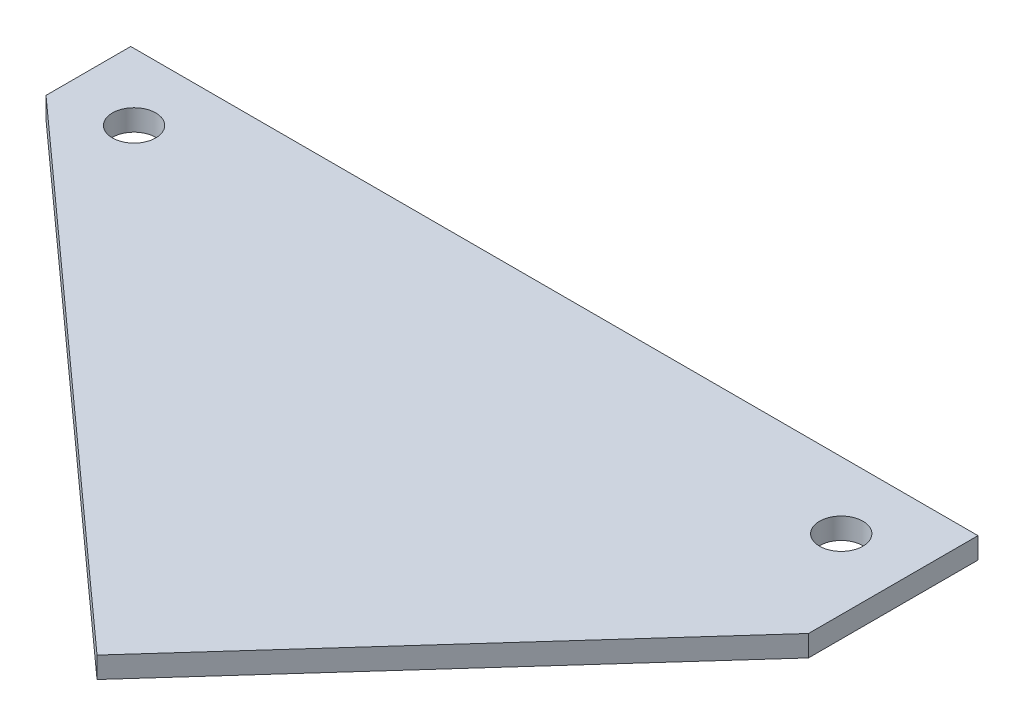
ISO-10303-21;
HEADER;
FILE_DESCRIPTION(('STEP AP214'),'2;1');
FILE_NAME('part.step','',(''),(''),'','','');
FILE_SCHEMA(('AUTOMOTIVE_DESIGN { 1 0 10303 214 1 1 1 1 }'));
ENDSEC;
DATA;
#1=APPLICATION_CONTEXT('core data for automotive mechanical design processes');
#2=APPLICATION_PROTOCOL_DEFINITION('international standard','automotive_design',2000,#1);
#3=PRODUCT_CONTEXT('',#1,'mechanical');
#4=PRODUCT('Part','Part','',(#3));
#5=PRODUCT_RELATED_PRODUCT_CATEGORY('part','',(#4));
#6=PRODUCT_DEFINITION_FORMATION('','',#4);
#7=PRODUCT_DEFINITION_CONTEXT('part definition',#1,'design');
#8=PRODUCT_DEFINITION('design','',#6,#7);
#9=PRODUCT_DEFINITION_SHAPE('','',#8);
#10=(LENGTH_UNIT() NAMED_UNIT(*) SI_UNIT(.MILLI.,.METRE.));
#11=(NAMED_UNIT(*) PLANE_ANGLE_UNIT() SI_UNIT($,.RADIAN.));
#12=(NAMED_UNIT(*) SI_UNIT($,.STERADIAN.) SOLID_ANGLE_UNIT());
#13=UNCERTAINTY_MEASURE_WITH_UNIT(LENGTH_MEASURE(1.E-05),#10,'distance_accuracy_value','');
#14=(GEOMETRIC_REPRESENTATION_CONTEXT(3) GLOBAL_UNCERTAINTY_ASSIGNED_CONTEXT((#13)) GLOBAL_UNIT_ASSIGNED_CONTEXT((#10,
#11,#12)) REPRESENTATION_CONTEXT('',''));
#15=CARTESIAN_POINT('',(0.,0.,0.));
#16=DIRECTION('',(0.,0.,1.));
#17=DIRECTION('',(1.,0.,0.));
#18=AXIS2_PLACEMENT_3D('',#15,#16,#17);
#19=CARTESIAN_POINT('',(-63.5,3.175,88.9));
#20=DIRECTION('',(-1.,0.,0.));
#21=DIRECTION('',(0.,0.,1.));
#22=AXIS2_PLACEMENT_3D('',#19,#20,#21);
#23=PLANE('',#22);
#24=DIRECTION('',(0.,0.,-1.));
#25=VECTOR('',#24,1.);
#26=CARTESIAN_POINT('',(-63.5,0.,88.9));
#27=LINE('',#26,#25);
#28=CARTESIAN_POINT('',(-63.5,0.,-25.4));
#29=VERTEX_POINT('',#28);
#30=CARTESIAN_POINT('',(-63.5,0.,-38.1));
#31=VERTEX_POINT('',#30);
#32=EDGE_CURVE('E125',#29,#31,#27,.T.);
#33=ORIENTED_EDGE('',*,*,#32,.F.);
#34=DIRECTION('',(0.,1.,0.));
#35=VECTOR('',#34,1.);
#36=CARTESIAN_POINT('',(-63.5,0.,-25.4));
#37=LINE('',#36,#35);
#38=CARTESIAN_POINT('',(-63.5,3.175,-25.4));
#39=VERTEX_POINT('',#38);
#40=EDGE_CURVE('E145',#29,#39,#37,.T.);
#41=ORIENTED_EDGE('',*,*,#40,.T.);
#42=DIRECTION('',(0.,0.,-1.));
#43=VECTOR('',#42,1.);
#44=CARTESIAN_POINT('',(-63.5,3.175,88.9));
#45=LINE('',#44,#43);
#46=CARTESIAN_POINT('',(-63.5,3.175,-38.1));
#47=VERTEX_POINT('',#46);
#48=EDGE_CURVE('E114',#39,#47,#45,.T.);
#49=ORIENTED_EDGE('',*,*,#48,.T.);
#50=DIRECTION('',(0.,-1.,0.));
#51=VECTOR('',#50,1.);
#52=CARTESIAN_POINT('',(-63.5,3.175,-38.1));
#53=LINE('',#52,#51);
#54=EDGE_CURVE('E72',#47,#31,#53,.T.);
#55=ORIENTED_EDGE('',*,*,#54,.T.);
#56=EDGE_LOOP('',(#33,#41,#49,#55));
#57=FACE_BOUND('',#56,.T.);
#58=ADVANCED_FACE('F69',(#57),#23,.T.);
#59=CARTESIAN_POINT('',(0.,3.175,0.));
#60=DIRECTION('',(0.,-1.,0.));
#61=DIRECTION('',(0.,0.,-1.));
#62=AXIS2_PLACEMENT_3D('',#59,#60,#61);
#63=PLANE('',#62);
#64=CARTESIAN_POINT('',(53.,3.175,-28.1000000000006));
#65=DIRECTION('',(0.,1.,0.));
#66=DIRECTION('',(0.,0.,1.));
#67=AXIS2_PLACEMENT_3D('',#64,#65,#66);
#68=CIRCLE('',#67,3.24999999999986);
#69=CARTESIAN_POINT('',(53.,3.175,-24.8500000000008));
#70=VERTEX_POINT('',#69);
#71=EDGE_CURVE('E140',#70,#70,#68,.T.);
#72=ORIENTED_EDGE('',*,*,#71,.F.);
#73=EDGE_LOOP('',(#72));
#74=FACE_BOUND('',#73,.T.);
#75=CARTESIAN_POINT('',(-53.,3.175,-28.1000000000006));
#76=DIRECTION('',(0.,1.,0.));
#77=DIRECTION('',(0.,0.,1.));
#78=AXIS2_PLACEMENT_3D('',#75,#76,#77);
#79=CIRCLE('',#78,3.24999999999986);
#80=CARTESIAN_POINT('',(-53.,3.175,-24.8500000000007));
#81=VERTEX_POINT('',#80);
#82=EDGE_CURVE('E134',#81,#81,#79,.T.);
#83=ORIENTED_EDGE('',*,*,#82,.F.);
#84=EDGE_LOOP('',(#83));
#85=FACE_BOUND('',#84,.T.);
#86=DIRECTION('',(0.743294146247166,0.,0.66896473162245));
#87=VECTOR('',#86,1.);
#88=CARTESIAN_POINT('',(-15.7872928176796,3.175,17.5414364640884));
#89=LINE('',#88,#87);
#90=CARTESIAN_POINT('',(12.9806629834254,3.175,43.4325966850829));
#91=VERTEX_POINT('',#90);
#92=EDGE_CURVE('E154',#39,#91,#89,.T.);
#93=ORIENTED_EDGE('',*,*,#92,.T.);
#94=DIRECTION('',(-0.66896473162245,0.,0.743294146247166));
#95=VECTOR('',#94,1.);
#96=CARTESIAN_POINT('',(28.767955801105,3.175,25.8911602209945));
#97=LINE('',#96,#95);
#98=CARTESIAN_POINT('',(63.5,3.175,-12.7));
#99=VERTEX_POINT('',#98);
#100=EDGE_CURVE('E151',#99,#91,#97,.T.);
#101=ORIENTED_EDGE('',*,*,#100,.F.);
#102=DIRECTION('',(0.,0.,-1.));
#103=VECTOR('',#102,1.);
#104=CARTESIAN_POINT('',(63.5,3.175,88.9));
#105=LINE('',#104,#103);
#106=CARTESIAN_POINT('',(63.5,3.175,-38.1));
#107=VERTEX_POINT('',#106);
#108=EDGE_CURVE('E92',#99,#107,#105,.T.);
#109=ORIENTED_EDGE('',*,*,#108,.T.);
#110=DIRECTION('',(1.,0.,0.));
#111=VECTOR('',#110,1.);
#112=CARTESIAN_POINT('',(-63.5,3.175,-38.1));
#113=LINE('',#112,#111);
#114=EDGE_CURVE('E121',#47,#107,#113,.T.);
#115=ORIENTED_EDGE('',*,*,#114,.F.);
#116=ORIENTED_EDGE('',*,*,#48,.F.);
#117=EDGE_LOOP('',(#93,#101,#109,#115,#116));
#118=FACE_BOUND('',#117,.T.);
#119=ADVANCED_FACE('F173',(#74,#85,#118),#63,.F.);
#120=CARTESIAN_POINT('',(0.,0.,0.));
#121=DIRECTION('',(0.,-1.,0.));
#122=DIRECTION('',(0.,0.,-1.));
#123=AXIS2_PLACEMENT_3D('',#120,#121,#122);
#124=PLANE('',#123);
#125=CARTESIAN_POINT('',(53.,0.,-28.1000000000006));
#126=DIRECTION('',(0.,1.,0.));
#127=DIRECTION('',(0.,0.,1.));
#128=AXIS2_PLACEMENT_3D('',#125,#126,#127);
#129=CIRCLE('',#128,3.24999999999986);
#130=CARTESIAN_POINT('',(53.,0.,-24.8500000000008));
#131=VERTEX_POINT('',#130);
#132=EDGE_CURVE('E137',#131,#131,#129,.T.);
#133=ORIENTED_EDGE('',*,*,#132,.T.);
#134=EDGE_LOOP('',(#133));
#135=FACE_BOUND('',#134,.T.);
#136=CARTESIAN_POINT('',(-53.,0.,-28.1000000000006));
#137=DIRECTION('',(0.,1.,0.));
#138=DIRECTION('',(0.,0.,1.));
#139=AXIS2_PLACEMENT_3D('',#136,#137,#138);
#140=CIRCLE('',#139,3.24999999999986);
#141=CARTESIAN_POINT('',(-53.,0.,-24.8500000000007));
#142=VERTEX_POINT('',#141);
#143=EDGE_CURVE('E128',#142,#142,#140,.T.);
#144=ORIENTED_EDGE('',*,*,#143,.T.);
#145=EDGE_LOOP('',(#144));
#146=FACE_BOUND('',#145,.T.);
#147=DIRECTION('',(-0.66896473162245,0.,0.743294146247166));
#148=VECTOR('',#147,1.);
#149=CARTESIAN_POINT('',(28.767955801105,0.,25.8911602209945));
#150=LINE('',#149,#148);
#151=CARTESIAN_POINT('',(63.5,0.,-12.7));
#152=VERTEX_POINT('',#151);
#153=CARTESIAN_POINT('',(12.9806629834254,0.,43.4325966850829));
#154=VERTEX_POINT('',#153);
#155=EDGE_CURVE('E148',#152,#154,#150,.T.);
#156=ORIENTED_EDGE('',*,*,#155,.T.);
#157=DIRECTION('',(0.743294146247166,0.,0.66896473162245));
#158=VECTOR('',#157,1.);
#159=CARTESIAN_POINT('',(-15.7872928176796,0.,17.5414364640884));
#160=LINE('',#159,#158);
#161=EDGE_CURVE('E153',#29,#154,#160,.T.);
#162=ORIENTED_EDGE('',*,*,#161,.F.);
#163=ORIENTED_EDGE('',*,*,#32,.T.);
#164=DIRECTION('',(1.,0.,0.));
#165=VECTOR('',#164,1.);
#166=CARTESIAN_POINT('',(-63.5,0.,-38.1));
#167=LINE('',#166,#165);
#168=CARTESIAN_POINT('',(63.5,0.,-38.1));
#169=VERTEX_POINT('',#168);
#170=EDGE_CURVE('E115',#31,#169,#167,.T.);
#171=ORIENTED_EDGE('',*,*,#170,.T.);
#172=DIRECTION('',(0.,0.,-1.));
#173=VECTOR('',#172,1.);
#174=CARTESIAN_POINT('',(63.5,0.,88.9));
#175=LINE('',#174,#173);
#176=EDGE_CURVE('E106',#152,#169,#175,.T.);
#177=ORIENTED_EDGE('',*,*,#176,.F.);
#178=EDGE_LOOP('',(#156,#162,#163,#171,#177));
#179=FACE_BOUND('',#178,.T.);
#180=ADVANCED_FACE('F122',(#135,#146,#179),#124,.T.);
#181=CARTESIAN_POINT('',(63.5,3.175,88.9));
#182=DIRECTION('',(-1.,0.,0.));
#183=DIRECTION('',(0.,0.,1.));
#184=AXIS2_PLACEMENT_3D('',#181,#182,#183);
#185=PLANE('',#184);
#186=ORIENTED_EDGE('',*,*,#108,.F.);
#187=DIRECTION('',(0.,1.,0.));
#188=VECTOR('',#187,1.);
#189=CARTESIAN_POINT('',(63.5,0.,-12.7));
#190=LINE('',#189,#188);
#191=EDGE_CURVE('E110',#152,#99,#190,.T.);
#192=ORIENTED_EDGE('',*,*,#191,.F.);
#193=ORIENTED_EDGE('',*,*,#176,.T.);
#194=DIRECTION('',(0.,-1.,0.));
#195=VECTOR('',#194,1.);
#196=CARTESIAN_POINT('',(63.5,3.175,-38.1));
#197=LINE('',#196,#195);
#198=EDGE_CURVE('E12',#107,#169,#197,.T.);
#199=ORIENTED_EDGE('',*,*,#198,.F.);
#200=EDGE_LOOP('',(#186,#192,#193,#199));
#201=FACE_BOUND('',#200,.T.);
#202=ADVANCED_FACE('F107',(#201),#185,.F.);
#203=CARTESIAN_POINT('',(-63.5,3.175,-38.1));
#204=DIRECTION('',(0.,0.,-1.));
#205=DIRECTION('',(-1.,0.,0.));
#206=AXIS2_PLACEMENT_3D('',#203,#204,#205);
#207=PLANE('',#206);
#208=ORIENTED_EDGE('',*,*,#170,.F.);
#209=ORIENTED_EDGE('',*,*,#54,.F.);
#210=ORIENTED_EDGE('',*,*,#114,.T.);
#211=ORIENTED_EDGE('',*,*,#198,.T.);
#212=EDGE_LOOP('',(#208,#209,#210,#211));
#213=FACE_BOUND('',#212,.T.);
#214=ADVANCED_FACE('F119',(#213),#207,.T.);
#215=CARTESIAN_POINT('',(-53.,0.,-28.1000000000006));
#216=DIRECTION('',(0.,1.,0.));
#217=DIRECTION('',(0.,0.,1.));
#218=AXIS2_PLACEMENT_3D('',#215,#216,#217);
#219=CYLINDRICAL_SURFACE('',#218,3.24999999999986);
#220=ORIENTED_EDGE('',*,*,#143,.F.);
#221=EDGE_LOOP('',(#220));
#222=FACE_BOUND('',#221,.T.);
#223=ORIENTED_EDGE('',*,*,#82,.T.);
#224=EDGE_LOOP('',(#223));
#225=FACE_BOUND('',#224,.T.);
#226=ADVANCED_FACE('F186',(#222,#225),#219,.F.);
#227=CARTESIAN_POINT('',(-15.7872928176796,0.,17.5414364640884));
#228=DIRECTION('',(-0.66896473162245,0.,0.743294146247166));
#229=DIRECTION('',(0.743294146247166,0.,0.66896473162245));
#230=AXIS2_PLACEMENT_3D('',#227,#228,#229);
#231=PLANE('',#230);
#232=ORIENTED_EDGE('',*,*,#92,.F.);
#233=ORIENTED_EDGE('',*,*,#40,.F.);
#234=ORIENTED_EDGE('',*,*,#161,.T.);
#235=DIRECTION('',(0.,1.,0.));
#236=VECTOR('',#235,1.);
#237=CARTESIAN_POINT('',(12.9806629834254,0.,43.4325966850829));
#238=LINE('',#237,#236);
#239=EDGE_CURVE('E83',#154,#91,#238,.T.);
#240=ORIENTED_EDGE('',*,*,#239,.T.);
#241=EDGE_LOOP('',(#232,#233,#234,#240));
#242=FACE_BOUND('',#241,.T.);
#243=ADVANCED_FACE('F161',(#242),#231,.T.);
#244=CARTESIAN_POINT('',(28.767955801105,0.,25.8911602209945));
#245=DIRECTION('',(-0.743294146247166,0.,-0.66896473162245));
#246=DIRECTION('',(-0.66896473162245,0.,0.743294146247166));
#247=AXIS2_PLACEMENT_3D('',#244,#245,#246);
#248=PLANE('',#247);
#249=ORIENTED_EDGE('',*,*,#100,.T.);
#250=ORIENTED_EDGE('',*,*,#239,.F.);
#251=ORIENTED_EDGE('',*,*,#155,.F.);
#252=ORIENTED_EDGE('',*,*,#191,.T.);
#253=EDGE_LOOP('',(#249,#250,#251,#252));
#254=FACE_BOUND('',#253,.T.);
#255=ADVANCED_FACE('F164',(#254),#248,.F.);
#256=CARTESIAN_POINT('',(53.,0.,-28.1000000000006));
#257=DIRECTION('',(0.,1.,0.));
#258=DIRECTION('',(0.,0.,1.));
#259=AXIS2_PLACEMENT_3D('',#256,#257,#258);
#260=CYLINDRICAL_SURFACE('',#259,3.24999999999986);
#261=ORIENTED_EDGE('',*,*,#132,.F.);
#262=EDGE_LOOP('',(#261));
#263=FACE_BOUND('',#262,.T.);
#264=ORIENTED_EDGE('',*,*,#71,.T.);
#265=EDGE_LOOP('',(#264));
#266=FACE_BOUND('',#265,.T.);
#267=ADVANCED_FACE('F206',(#263,#266),#260,.F.);
#268=CLOSED_SHELL('',(#58,#119,#180,#202,#214,#226,#243,#255,#267));
#269=MANIFOLD_SOLID_BREP('B2',#268);
#270=ADVANCED_BREP_SHAPE_REPRESENTATION('',(#18,#269),#14);
#271=SHAPE_DEFINITION_REPRESENTATION(#9,#270);
ENDSEC;
END-ISO-10303-21;
